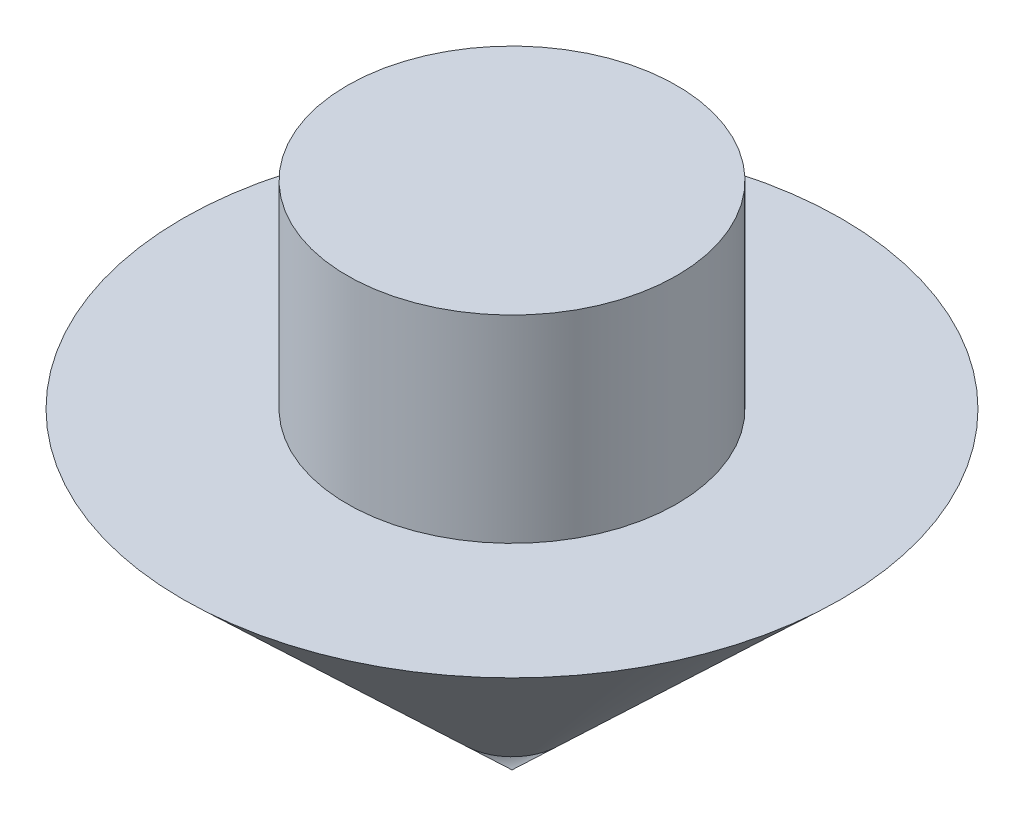
ISO-10303-21;
HEADER;
FILE_DESCRIPTION(('STEP AP214'),'2;1');
FILE_NAME('part.step','',(''),(''),'','','');
FILE_SCHEMA(('AUTOMOTIVE_DESIGN { 1 0 10303 214 1 1 1 1 }'));
ENDSEC;
DATA;
#1=APPLICATION_CONTEXT('core data for automotive mechanical design processes');
#2=APPLICATION_PROTOCOL_DEFINITION('international standard','automotive_design',2000,#1);
#3=PRODUCT_CONTEXT('',#1,'mechanical');
#4=PRODUCT('Part','Part','',(#3));
#5=PRODUCT_RELATED_PRODUCT_CATEGORY('part','',(#4));
#6=PRODUCT_DEFINITION_FORMATION('','',#4);
#7=PRODUCT_DEFINITION_CONTEXT('part definition',#1,'design');
#8=PRODUCT_DEFINITION('design','',#6,#7);
#9=PRODUCT_DEFINITION_SHAPE('','',#8);
#10=(LENGTH_UNIT() NAMED_UNIT(*) SI_UNIT(.MILLI.,.METRE.));
#11=(NAMED_UNIT(*) PLANE_ANGLE_UNIT() SI_UNIT($,.RADIAN.));
#12=(NAMED_UNIT(*) SI_UNIT($,.STERADIAN.) SOLID_ANGLE_UNIT());
#13=UNCERTAINTY_MEASURE_WITH_UNIT(LENGTH_MEASURE(1.E-05),#10,'distance_accuracy_value','');
#14=(GEOMETRIC_REPRESENTATION_CONTEXT(3) GLOBAL_UNCERTAINTY_ASSIGNED_CONTEXT((#13)) GLOBAL_UNIT_ASSIGNED_CONTEXT((#10,
#11,#12)) REPRESENTATION_CONTEXT('',''));
#15=CARTESIAN_POINT('',(0.,0.,0.));
#16=DIRECTION('',(0.,0.,1.));
#17=DIRECTION('',(1.,0.,0.));
#18=AXIS2_PLACEMENT_3D('',#15,#16,#17);
#19=CARTESIAN_POINT('',(0.,0.,0.));
#20=DIRECTION('',(0.,1.,0.));
#21=DIRECTION('',(-1.,0.,0.));
#22=AXIS2_PLACEMENT_3D('',#19,#20,#21);
#23=CONICAL_SURFACE('',#22,0.,0.811578102177365);
#24=CARTESIAN_POINT('',(0.,9.48964566714877,0.));
#25=DIRECTION('',(0.,-1.,0.));
#26=DIRECTION('',(1.,0.,0.));
#27=AXIS2_PLACEMENT_3D('',#24,#25,#26);
#28=CIRCLE('',#27,10.);
#29=CARTESIAN_POINT('',(10.,9.48964566714877,0.));
#30=VERTEX_POINT('',#29);
#31=EDGE_CURVE('E11',#30,#30,#28,.T.);
#32=ORIENTED_EDGE('',*,*,#31,.T.);
#33=EDGE_LOOP('',(#32));
#34=FACE_BOUND('',#33,.T.);
#35=CARTESIAN_POINT('',(0.,0.,0.));
#36=VERTEX_POINT('',#35);
#37=VERTEX_LOOP('',#36);
#38=FACE_BOUND('',#37,.T.);
#39=ADVANCED_FACE('F43',(#34,#38),#23,.T.);
#40=CARTESIAN_POINT('',(0.,9.48964566714877,0.));
#41=DIRECTION('',(0.,1.,0.));
#42=DIRECTION('',(-1.,0.,0.));
#43=AXIS2_PLACEMENT_3D('',#40,#41,#42);
#44=PLANE('',#43);
#45=CARTESIAN_POINT('',(0.,9.48964566714877,0.));
#46=DIRECTION('',(0.,-1.,0.));
#47=DIRECTION('',(1.,0.,0.));
#48=AXIS2_PLACEMENT_3D('',#45,#46,#47);
#49=CIRCLE('',#48,5.);
#50=CARTESIAN_POINT('',(5.,9.48964566714877,0.));
#51=VERTEX_POINT('',#50);
#52=EDGE_CURVE('E50',#51,#51,#49,.T.);
#53=ORIENTED_EDGE('',*,*,#52,.T.);
#54=EDGE_LOOP('',(#53));
#55=FACE_BOUND('',#54,.T.);
#56=ORIENTED_EDGE('',*,*,#31,.F.);
#57=EDGE_LOOP('',(#56));
#58=FACE_BOUND('',#57,.T.);
#59=ADVANCED_FACE('F54',(#55,#58),#44,.T.);
#60=CARTESIAN_POINT('',(0.,0.,0.));
#61=DIRECTION('',(0.,-1.,0.));
#62=DIRECTION('',(1.,0.,0.));
#63=AXIS2_PLACEMENT_3D('',#60,#61,#62);
#64=CYLINDRICAL_SURFACE('',#63,5.);
#65=CARTESIAN_POINT('',(0.,15.4896456671488,0.));
#66=DIRECTION('',(0.,-1.,0.));
#67=DIRECTION('',(1.,0.,0.));
#68=AXIS2_PLACEMENT_3D('',#65,#66,#67);
#69=CIRCLE('',#68,5.);
#70=CARTESIAN_POINT('',(5.,15.4896456671488,0.));
#71=VERTEX_POINT('',#70);
#72=EDGE_CURVE('E77',#71,#71,#69,.T.);
#73=ORIENTED_EDGE('',*,*,#72,.T.);
#74=EDGE_LOOP('',(#73));
#75=FACE_BOUND('',#74,.T.);
#76=ORIENTED_EDGE('',*,*,#52,.F.);
#77=EDGE_LOOP('',(#76));
#78=FACE_BOUND('',#77,.T.);
#79=ADVANCED_FACE('F59',(#75,#78),#64,.T.);
#80=CARTESIAN_POINT('',(0.,15.4896456671488,0.));
#81=DIRECTION('',(0.,-1.,0.));
#82=DIRECTION('',(1.,0.,0.));
#83=AXIS2_PLACEMENT_3D('',#80,#81,#82);
#84=PLANE('',#83);
#85=ORIENTED_EDGE('',*,*,#72,.F.);
#86=EDGE_LOOP('',(#85));
#87=FACE_BOUND('',#86,.T.);
#88=ADVANCED_FACE('F66',(#87),#84,.F.);
#89=CLOSED_SHELL('',(#39,#59,#79,#88));
#90=MANIFOLD_SOLID_BREP('B2',#89);
#91=ADVANCED_BREP_SHAPE_REPRESENTATION('',(#18,#90),#14);
#92=SHAPE_DEFINITION_REPRESENTATION(#9,#91);
ENDSEC;
END-ISO-10303-21;
